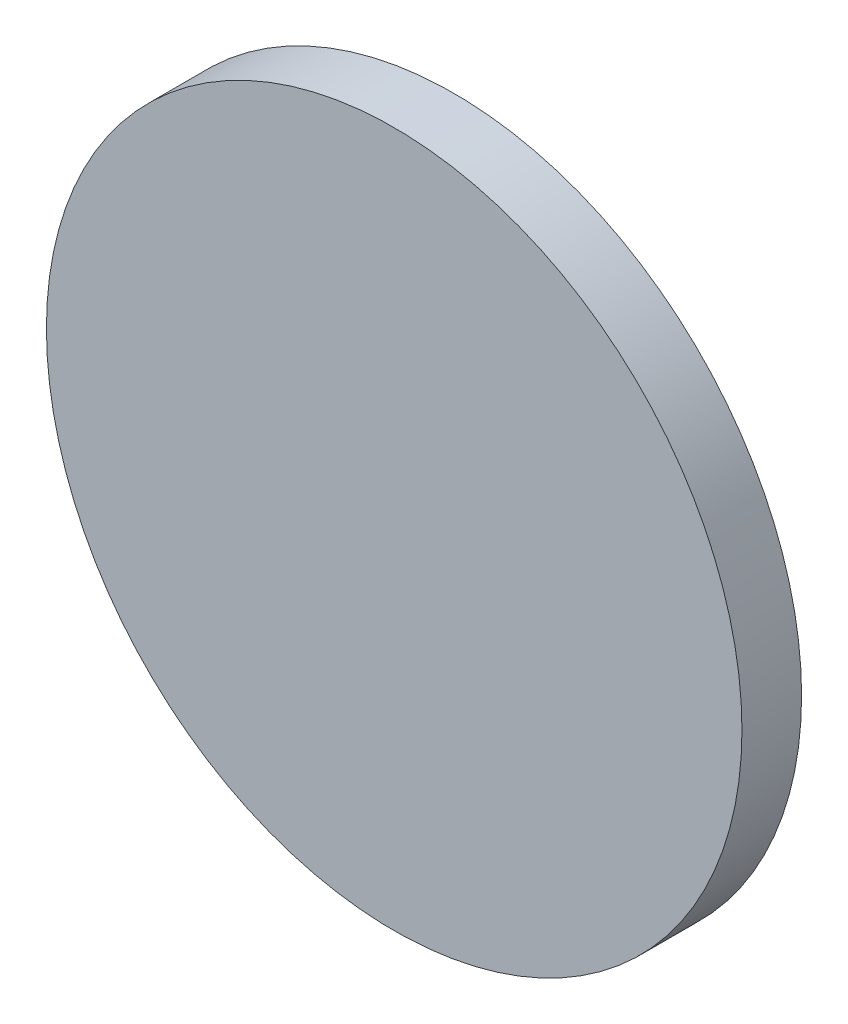
ISO-10303-21;
HEADER;
FILE_DESCRIPTION(('STEP AP214'),'2;1');
FILE_NAME('part.step','',(''),(''),'','','');
FILE_SCHEMA(('AUTOMOTIVE_DESIGN { 1 0 10303 214 1 1 1 1 }'));
ENDSEC;
DATA;
#1=APPLICATION_CONTEXT('core data for automotive mechanical design processes');
#2=APPLICATION_PROTOCOL_DEFINITION('international standard','automotive_design',2000,#1);
#3=PRODUCT_CONTEXT('',#1,'mechanical');
#4=PRODUCT('Part','Part','',(#3));
#5=PRODUCT_RELATED_PRODUCT_CATEGORY('part','',(#4));
#6=PRODUCT_DEFINITION_FORMATION('','',#4);
#7=PRODUCT_DEFINITION_CONTEXT('part definition',#1,'design');
#8=PRODUCT_DEFINITION('design','',#6,#7);
#9=PRODUCT_DEFINITION_SHAPE('','',#8);
#10=(LENGTH_UNIT() NAMED_UNIT(*) SI_UNIT(.MILLI.,.METRE.));
#11=(NAMED_UNIT(*) PLANE_ANGLE_UNIT() SI_UNIT($,.RADIAN.));
#12=(NAMED_UNIT(*) SI_UNIT($,.STERADIAN.) SOLID_ANGLE_UNIT());
#13=UNCERTAINTY_MEASURE_WITH_UNIT(LENGTH_MEASURE(1.E-05),#10,'distance_accuracy_value','');
#14=(GEOMETRIC_REPRESENTATION_CONTEXT(3) GLOBAL_UNCERTAINTY_ASSIGNED_CONTEXT((#13)) GLOBAL_UNIT_ASSIGNED_CONTEXT((#10,
#11,#12)) REPRESENTATION_CONTEXT('',''));
#15=CARTESIAN_POINT('',(0.,0.,0.));
#16=DIRECTION('',(0.,0.,1.));
#17=DIRECTION('',(1.,0.,0.));
#18=AXIS2_PLACEMENT_3D('',#15,#16,#17);
#19=CARTESIAN_POINT('',(1.63322,6.197600006176,0.));
#20=DIRECTION('',(0.,0.,-1.));
#21=DIRECTION('',(-1.,0.,0.));
#22=AXIS2_PLACEMENT_3D('',#19,#20,#21);
#23=PLANE('',#22);
#24=CARTESIAN_POINT('',(1.63322,6.197600006176,0.));
#25=DIRECTION('',(0.,0.,1.));
#26=DIRECTION('',(1.,0.,0.));
#27=AXIS2_PLACEMENT_3D('',#24,#25,#26);
#28=CIRCLE('',#27,0.200024667);
#29=CARTESIAN_POINT('',(1.833244667,6.197600006176,0.));
#30=VERTEX_POINT('',#29);
#31=EDGE_CURVE('E18',#30,#30,#28,.T.);
#32=ORIENTED_EDGE('',*,*,#31,.F.);
#33=EDGE_LOOP('',(#32));
#34=FACE_BOUND('',#33,.T.);
#35=ADVANCED_FACE('F15',(#34),#23,.T.);
#36=CARTESIAN_POINT('',(1.63322,6.197600006176,0.));
#37=DIRECTION('',(0.,0.,1.));
#38=DIRECTION('',(1.,0.,0.));
#39=AXIS2_PLACEMENT_3D('',#36,#37,#38);
#40=CYLINDRICAL_SURFACE('',#39,0.200024667);
#41=CARTESIAN_POINT('',(1.63322,6.197600006176,0.03429));
#42=DIRECTION('',(0.,0.,1.));
#43=DIRECTION('',(1.,0.,0.));
#44=AXIS2_PLACEMENT_3D('',#41,#42,#43);
#45=CIRCLE('',#44,0.200024667);
#46=CARTESIAN_POINT('',(1.833244667,6.197600006176,0.03429));
#47=VERTEX_POINT('',#46);
#48=EDGE_CURVE('E10',#47,#47,#45,.T.);
#49=ORIENTED_EDGE('',*,*,#48,.F.);
#50=EDGE_LOOP('',(#49));
#51=FACE_BOUND('',#50,.T.);
#52=ORIENTED_EDGE('',*,*,#31,.T.);
#53=EDGE_LOOP('',(#52));
#54=FACE_BOUND('',#53,.T.);
#55=ADVANCED_FACE('F27',(#51,#54),#40,.T.);
#56=CARTESIAN_POINT('',(1.63322,6.197600006176,0.03429));
#57=DIRECTION('',(0.,0.,1.));
#58=DIRECTION('',(1.,0.,0.));
#59=AXIS2_PLACEMENT_3D('',#56,#57,#58);
#60=PLANE('',#59);
#61=ORIENTED_EDGE('',*,*,#48,.T.);
#62=EDGE_LOOP('',(#61));
#63=FACE_BOUND('',#62,.T.);
#64=ADVANCED_FACE('F34',(#63),#60,.T.);
#65=CLOSED_SHELL('',(#35,#55,#64));
#66=MANIFOLD_SOLID_BREP('B1',#65);
#67=ADVANCED_BREP_SHAPE_REPRESENTATION('',(#18,#66),#14);
#68=SHAPE_DEFINITION_REPRESENTATION(#9,#67);
ENDSEC;
END-ISO-10303-21;
